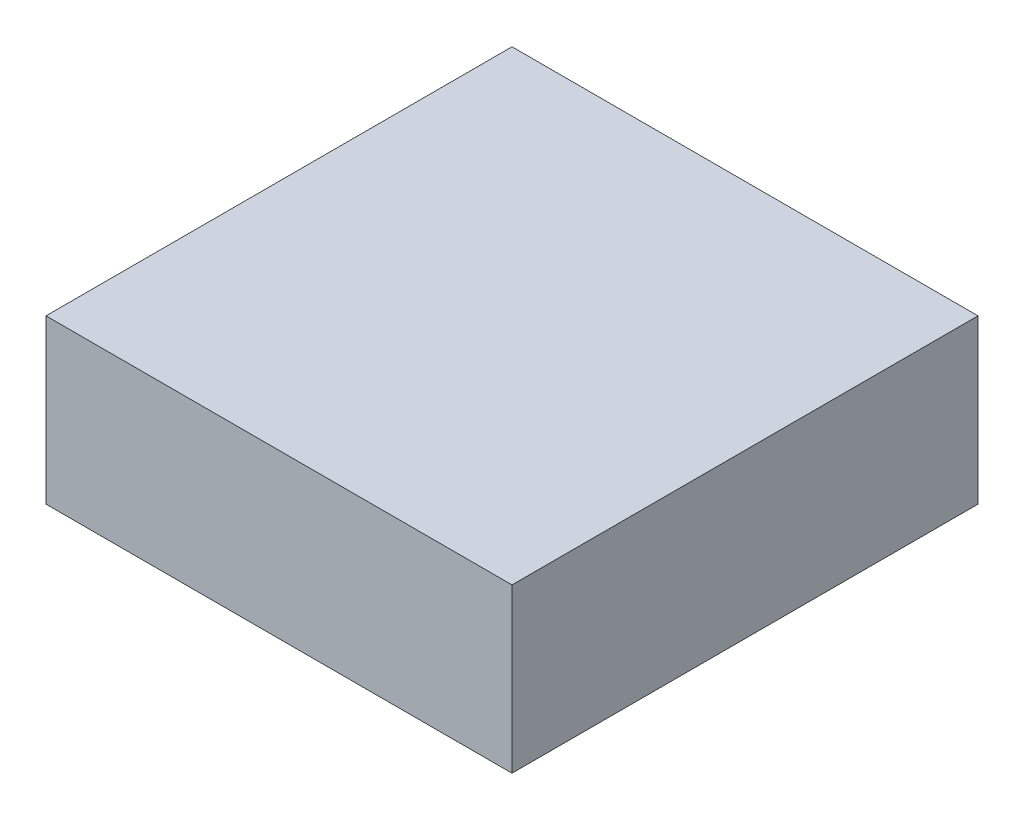
ISO-10303-21;
HEADER;
FILE_DESCRIPTION(('STEP AP214'),'2;1');
FILE_NAME('part.step','',(''),(''),'','','');
FILE_SCHEMA(('AUTOMOTIVE_DESIGN { 1 0 10303 214 1 1 1 1 }'));
ENDSEC;
DATA;
#1=APPLICATION_CONTEXT('core data for automotive mechanical design processes');
#2=APPLICATION_PROTOCOL_DEFINITION('international standard','automotive_design',2000,#1);
#3=PRODUCT_CONTEXT('',#1,'mechanical');
#4=PRODUCT('Part','Part','',(#3));
#5=PRODUCT_RELATED_PRODUCT_CATEGORY('part','',(#4));
#6=PRODUCT_DEFINITION_FORMATION('','',#4);
#7=PRODUCT_DEFINITION_CONTEXT('part definition',#1,'design');
#8=PRODUCT_DEFINITION('design','',#6,#7);
#9=PRODUCT_DEFINITION_SHAPE('','',#8);
#10=(LENGTH_UNIT() NAMED_UNIT(*) SI_UNIT(.MILLI.,.METRE.));
#11=(NAMED_UNIT(*) PLANE_ANGLE_UNIT() SI_UNIT($,.RADIAN.));
#12=(NAMED_UNIT(*) SI_UNIT($,.STERADIAN.) SOLID_ANGLE_UNIT());
#13=UNCERTAINTY_MEASURE_WITH_UNIT(LENGTH_MEASURE(1.E-05),#10,'distance_accuracy_value','');
#14=(GEOMETRIC_REPRESENTATION_CONTEXT(3) GLOBAL_UNCERTAINTY_ASSIGNED_CONTEXT((#13)) GLOBAL_UNIT_ASSIGNED_CONTEXT((#10,
#11,#12)) REPRESENTATION_CONTEXT('',''));
#15=CARTESIAN_POINT('',(0.,0.,0.));
#16=DIRECTION('',(0.,0.,1.));
#17=DIRECTION('',(1.,0.,0.));
#18=AXIS2_PLACEMENT_3D('',#15,#16,#17);
#19=CARTESIAN_POINT('',(0.,1.75,0.));
#20=DIRECTION('',(1.,0.,0.));
#21=DIRECTION('',(0.,0.,-1.));
#22=AXIS2_PLACEMENT_3D('',#19,#20,#21);
#23=PLANE('',#22);
#24=DIRECTION('',(0.,0.,1.));
#25=VECTOR('',#24,1.);
#26=CARTESIAN_POINT('',(0.,0.,0.));
#27=LINE('',#26,#25);
#28=CARTESIAN_POINT('',(0.,0.,-5.));
#29=VERTEX_POINT('',#28);
#30=CARTESIAN_POINT('',(0.,0.,0.));
#31=VERTEX_POINT('',#30);
#32=EDGE_CURVE('E100',#29,#31,#27,.T.);
#33=ORIENTED_EDGE('',*,*,#32,.T.);
#34=DIRECTION('',(0.,-1.,0.));
#35=VECTOR('',#34,1.);
#36=CARTESIAN_POINT('',(0.,1.75,0.));
#37=LINE('',#36,#35);
#38=CARTESIAN_POINT('',(0.,1.75,0.));
#39=VERTEX_POINT('',#38);
#40=EDGE_CURVE('E11',#39,#31,#37,.T.);
#41=ORIENTED_EDGE('',*,*,#40,.F.);
#42=DIRECTION('',(0.,0.,1.));
#43=VECTOR('',#42,1.);
#44=CARTESIAN_POINT('',(0.,1.75,0.));
#45=LINE('',#44,#43);
#46=CARTESIAN_POINT('',(0.,1.75,-5.));
#47=VERTEX_POINT('',#46);
#48=EDGE_CURVE('E88',#47,#39,#45,.T.);
#49=ORIENTED_EDGE('',*,*,#48,.F.);
#50=DIRECTION('',(0.,-1.,0.));
#51=VECTOR('',#50,1.);
#52=CARTESIAN_POINT('',(0.,1.75,-5.));
#53=LINE('',#52,#51);
#54=EDGE_CURVE('E96',#47,#29,#53,.T.);
#55=ORIENTED_EDGE('',*,*,#54,.T.);
#56=EDGE_LOOP('',(#33,#41,#49,#55));
#57=FACE_BOUND('',#56,.T.);
#58=ADVANCED_FACE('F37',(#57),#23,.F.);
#59=CARTESIAN_POINT('',(0.,1.75,0.));
#60=DIRECTION('',(0.,0.,-1.));
#61=DIRECTION('',(-1.,0.,0.));
#62=AXIS2_PLACEMENT_3D('',#59,#60,#61);
#63=PLANE('',#62);
#64=DIRECTION('',(1.,0.,0.));
#65=VECTOR('',#64,1.);
#66=CARTESIAN_POINT('',(0.,0.,0.));
#67=LINE('',#66,#65);
#68=CARTESIAN_POINT('',(5.,0.,0.));
#69=VERTEX_POINT('',#68);
#70=EDGE_CURVE('E92',#31,#69,#67,.T.);
#71=ORIENTED_EDGE('',*,*,#70,.T.);
#72=DIRECTION('',(0.,-1.,0.));
#73=VECTOR('',#72,1.);
#74=CARTESIAN_POINT('',(5.,1.75,0.));
#75=LINE('',#74,#73);
#76=CARTESIAN_POINT('',(5.,1.75,0.));
#77=VERTEX_POINT('',#76);
#78=EDGE_CURVE('E45',#77,#69,#75,.T.);
#79=ORIENTED_EDGE('',*,*,#78,.F.);
#80=DIRECTION('',(1.,0.,0.));
#81=VECTOR('',#80,1.);
#82=CARTESIAN_POINT('',(0.,1.75,0.));
#83=LINE('',#82,#81);
#84=EDGE_CURVE('E83',#39,#77,#83,.T.);
#85=ORIENTED_EDGE('',*,*,#84,.F.);
#86=ORIENTED_EDGE('',*,*,#40,.T.);
#87=EDGE_LOOP('',(#71,#79,#85,#86));
#88=FACE_BOUND('',#87,.T.);
#89=ADVANCED_FACE('F91',(#88),#63,.F.);
#90=CARTESIAN_POINT('',(5.,1.75,0.));
#91=DIRECTION('',(-1.,0.,0.));
#92=DIRECTION('',(0.,0.,1.));
#93=AXIS2_PLACEMENT_3D('',#90,#91,#92);
#94=PLANE('',#93);
#95=DIRECTION('',(0.,0.,-1.));
#96=VECTOR('',#95,1.);
#97=CARTESIAN_POINT('',(5.,0.,0.));
#98=LINE('',#97,#96);
#99=CARTESIAN_POINT('',(5.,0.,-5.));
#100=VERTEX_POINT('',#99);
#101=EDGE_CURVE('E70',#69,#100,#98,.T.);
#102=ORIENTED_EDGE('',*,*,#101,.T.);
#103=DIRECTION('',(0.,-1.,0.));
#104=VECTOR('',#103,1.);
#105=CARTESIAN_POINT('',(5.,1.75,-5.));
#106=LINE('',#105,#104);
#107=CARTESIAN_POINT('',(5.,1.75,-5.));
#108=VERTEX_POINT('',#107);
#109=EDGE_CURVE('E93',#108,#100,#106,.T.);
#110=ORIENTED_EDGE('',*,*,#109,.F.);
#111=DIRECTION('',(0.,0.,-1.));
#112=VECTOR('',#111,1.);
#113=CARTESIAN_POINT('',(5.,1.75,0.));
#114=LINE('',#113,#112);
#115=EDGE_CURVE('E86',#77,#108,#114,.T.);
#116=ORIENTED_EDGE('',*,*,#115,.F.);
#117=ORIENTED_EDGE('',*,*,#78,.T.);
#118=EDGE_LOOP('',(#102,#110,#116,#117));
#119=FACE_BOUND('',#118,.T.);
#120=ADVANCED_FACE('F94',(#119),#94,.F.);
#121=CARTESIAN_POINT('',(0.,1.75,-5.));
#122=DIRECTION('',(0.,0.,1.));
#123=DIRECTION('',(1.,0.,0.));
#124=AXIS2_PLACEMENT_3D('',#121,#122,#123);
#125=PLANE('',#124);
#126=DIRECTION('',(-1.,0.,0.));
#127=VECTOR('',#126,1.);
#128=CARTESIAN_POINT('',(0.,0.,-5.));
#129=LINE('',#128,#127);
#130=EDGE_CURVE('E76',#100,#29,#129,.T.);
#131=ORIENTED_EDGE('',*,*,#130,.T.);
#132=ORIENTED_EDGE('',*,*,#54,.F.);
#133=DIRECTION('',(-1.,0.,0.));
#134=VECTOR('',#133,1.);
#135=CARTESIAN_POINT('',(0.,1.75,-5.));
#136=LINE('',#135,#134);
#137=EDGE_CURVE('E53',#108,#47,#136,.T.);
#138=ORIENTED_EDGE('',*,*,#137,.F.);
#139=ORIENTED_EDGE('',*,*,#109,.T.);
#140=EDGE_LOOP('',(#131,#132,#138,#139));
#141=FACE_BOUND('',#140,.T.);
#142=ADVANCED_FACE('F107',(#141),#125,.F.);
#143=CARTESIAN_POINT('',(0.,1.75,0.));
#144=DIRECTION('',(0.,-1.,0.));
#145=DIRECTION('',(0.,0.,-1.));
#146=AXIS2_PLACEMENT_3D('',#143,#144,#145);
#147=PLANE('',#146);
#148=ORIENTED_EDGE('',*,*,#48,.T.);
#149=ORIENTED_EDGE('',*,*,#84,.T.);
#150=ORIENTED_EDGE('',*,*,#115,.T.);
#151=ORIENTED_EDGE('',*,*,#137,.T.);
#152=EDGE_LOOP('',(#148,#149,#150,#151));
#153=FACE_BOUND('',#152,.T.);
#154=ADVANCED_FACE('F84',(#153),#147,.F.);
#155=CARTESIAN_POINT('',(0.,0.,0.));
#156=DIRECTION('',(0.,-1.,0.));
#157=DIRECTION('',(0.,0.,-1.));
#158=AXIS2_PLACEMENT_3D('',#155,#156,#157);
#159=PLANE('',#158);
#160=ORIENTED_EDGE('',*,*,#32,.F.);
#161=ORIENTED_EDGE('',*,*,#130,.F.);
#162=ORIENTED_EDGE('',*,*,#101,.F.);
#163=ORIENTED_EDGE('',*,*,#70,.F.);
#164=EDGE_LOOP('',(#160,#161,#162,#163));
#165=FACE_BOUND('',#164,.T.);
#166=ADVANCED_FACE('F110',(#165),#159,.T.);
#167=CLOSED_SHELL('',(#58,#89,#120,#142,#154,#166));
#168=MANIFOLD_SOLID_BREP('B2',#167);
#169=ADVANCED_BREP_SHAPE_REPRESENTATION('',(#18,#168),#14);
#170=SHAPE_DEFINITION_REPRESENTATION(#9,#169);
ENDSEC;
END-ISO-10303-21;
